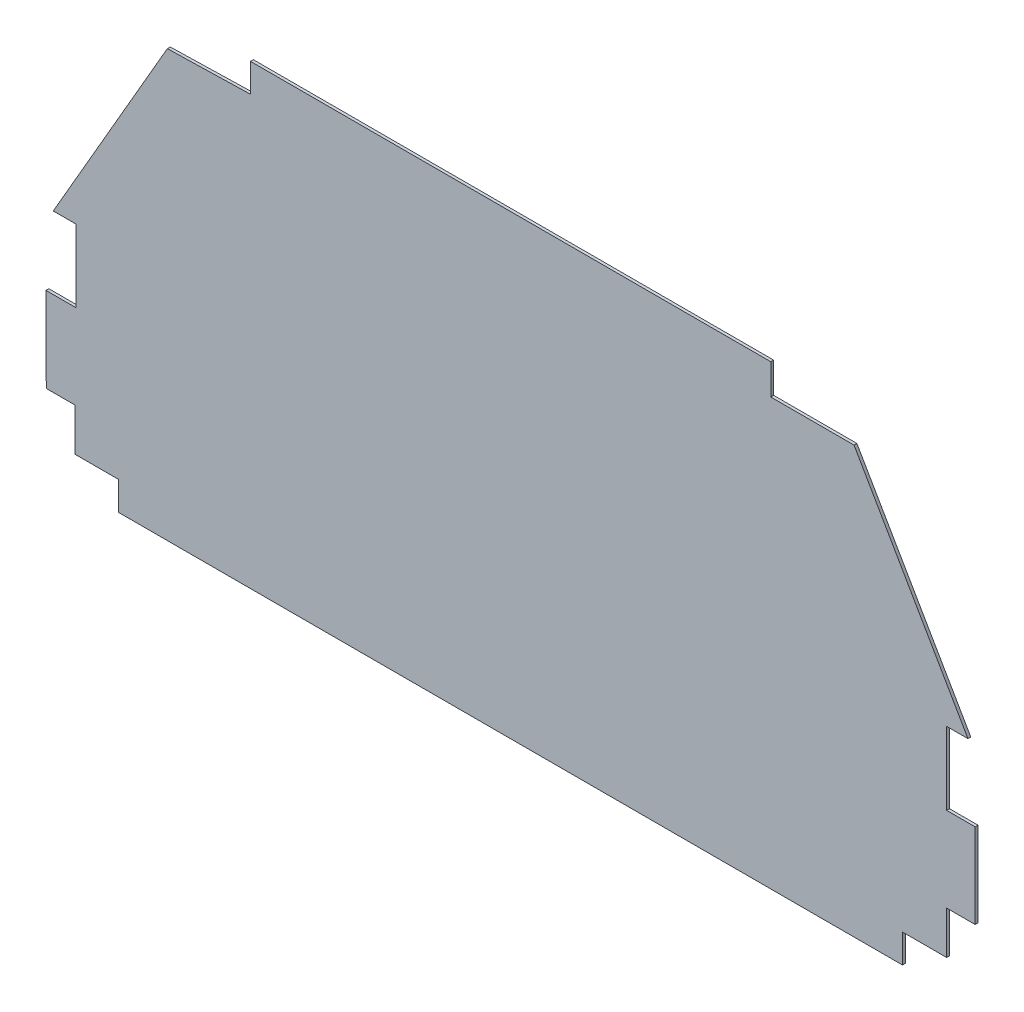
ISO-10303-21;
HEADER;
FILE_DESCRIPTION(('STEP AP214'),'2;1');
FILE_NAME('part.step','',(''),(''),'','','');
FILE_SCHEMA(('AUTOMOTIVE_DESIGN { 1 0 10303 214 1 1 1 1 }'));
ENDSEC;
DATA;
#1=APPLICATION_CONTEXT('core data for automotive mechanical design processes');
#2=APPLICATION_PROTOCOL_DEFINITION('international standard','automotive_design',2000,#1);
#3=PRODUCT_CONTEXT('',#1,'mechanical');
#4=PRODUCT('Part','Part','',(#3));
#5=PRODUCT_RELATED_PRODUCT_CATEGORY('part','',(#4));
#6=PRODUCT_DEFINITION_FORMATION('','',#4);
#7=PRODUCT_DEFINITION_CONTEXT('part definition',#1,'design');
#8=PRODUCT_DEFINITION('design','',#6,#7);
#9=PRODUCT_DEFINITION_SHAPE('','',#8);
#10=(LENGTH_UNIT() NAMED_UNIT(*) SI_UNIT(.MILLI.,.METRE.));
#11=(NAMED_UNIT(*) PLANE_ANGLE_UNIT() SI_UNIT($,.RADIAN.));
#12=(NAMED_UNIT(*) SI_UNIT($,.STERADIAN.) SOLID_ANGLE_UNIT());
#13=UNCERTAINTY_MEASURE_WITH_UNIT(LENGTH_MEASURE(1.E-05),#10,'distance_accuracy_value','');
#14=(GEOMETRIC_REPRESENTATION_CONTEXT(3) GLOBAL_UNCERTAINTY_ASSIGNED_CONTEXT((#13)) GLOBAL_UNIT_ASSIGNED_CONTEXT((#10,
#11,#12)) REPRESENTATION_CONTEXT('',''));
#15=CARTESIAN_POINT('',(0.,0.,0.));
#16=DIRECTION('',(0.,0.,1.));
#17=DIRECTION('',(1.,0.,0.));
#18=AXIS2_PLACEMENT_3D('',#15,#16,#17);
#19=CARTESIAN_POINT('',(497.289305676429,278.585286053824,2.));
#20=DIRECTION('',(-1.,0.,0.));
#21=DIRECTION('',(0.,0.,1.));
#22=AXIS2_PLACEMENT_3D('',#19,#20,#21);
#23=PLANE('',#22);
#24=DIRECTION('',(0.,1.,0.));
#25=VECTOR('',#24,1.);
#26=CARTESIAN_POINT('',(497.289305676429,278.585286053824,0.));
#27=LINE('',#26,#25);
#28=CARTESIAN_POINT('',(497.289305676429,278.585286053824,0.));
#29=VERTEX_POINT('',#28);
#30=CARTESIAN_POINT('',(497.289305676429,300.001319811247,0.));
#31=VERTEX_POINT('',#30);
#32=EDGE_CURVE('E224',#29,#31,#27,.T.);
#33=ORIENTED_EDGE('',*,*,#32,.T.);
#34=DIRECTION('',(0.,0.,-1.));
#35=VECTOR('',#34,1.);
#36=CARTESIAN_POINT('',(497.289305676429,300.001319811247,2.));
#37=LINE('',#36,#35);
#38=CARTESIAN_POINT('',(497.289305676429,300.001319811247,2.));
#39=VERTEX_POINT('',#38);
#40=EDGE_CURVE('E11',#39,#31,#37,.T.);
#41=ORIENTED_EDGE('',*,*,#40,.F.);
#42=DIRECTION('',(0.,1.,0.));
#43=VECTOR('',#42,1.);
#44=CARTESIAN_POINT('',(497.289305676429,278.585286053824,2.));
#45=LINE('',#44,#43);
#46=CARTESIAN_POINT('',(497.289305676429,278.585286053824,2.));
#47=VERTEX_POINT('',#46);
#48=EDGE_CURVE('E270',#47,#39,#45,.T.);
#49=ORIENTED_EDGE('',*,*,#48,.F.);
#50=DIRECTION('',(0.,0.,-1.));
#51=VECTOR('',#50,1.);
#52=CARTESIAN_POINT('',(497.289305676429,278.585286053824,2.));
#53=LINE('',#52,#51);
#54=EDGE_CURVE('E220',#47,#29,#53,.T.);
#55=ORIENTED_EDGE('',*,*,#54,.T.);
#56=EDGE_LOOP('',(#33,#41,#49,#55));
#57=FACE_BOUND('',#56,.T.);
#58=ADVANCED_FACE('F32',(#57),#23,.F.);
#59=CARTESIAN_POINT('',(497.289305676429,300.001319811247,2.));
#60=DIRECTION('',(0.,-1.,0.));
#61=DIRECTION('',(0.,0.,-1.));
#62=AXIS2_PLACEMENT_3D('',#59,#60,#61);
#63=PLANE('',#62);
#64=DIRECTION('',(-1.,0.,0.));
#65=VECTOR('',#64,1.);
#66=CARTESIAN_POINT('',(497.289305676429,300.001319811247,0.));
#67=LINE('',#66,#65);
#68=CARTESIAN_POINT('',(132.637060910832,300.001319811247,0.));
#69=VERTEX_POINT('',#68);
#70=EDGE_CURVE('E227',#31,#69,#67,.T.);
#71=ORIENTED_EDGE('',*,*,#70,.T.);
#72=DIRECTION('',(0.,0.,-1.));
#73=VECTOR('',#72,1.);
#74=CARTESIAN_POINT('',(132.637060910832,300.001319811247,2.));
#75=LINE('',#74,#73);
#76=CARTESIAN_POINT('',(132.637060910832,300.001319811247,2.));
#77=VERTEX_POINT('',#76);
#78=EDGE_CURVE('E40',#77,#69,#75,.T.);
#79=ORIENTED_EDGE('',*,*,#78,.F.);
#80=DIRECTION('',(-1.,0.,0.));
#81=VECTOR('',#80,1.);
#82=CARTESIAN_POINT('',(497.289305676429,300.001319811247,2.));
#83=LINE('',#82,#81);
#84=EDGE_CURVE('E139',#39,#77,#83,.T.);
#85=ORIENTED_EDGE('',*,*,#84,.F.);
#86=ORIENTED_EDGE('',*,*,#40,.T.);
#87=EDGE_LOOP('',(#71,#79,#85,#86));
#88=FACE_BOUND('',#87,.T.);
#89=ADVANCED_FACE('F408',(#88),#63,.F.);
#90=CARTESIAN_POINT('',(132.637060910832,300.001319811247,2.));
#91=DIRECTION('',(1.,0.,0.));
#92=DIRECTION('',(0.,0.,-1.));
#93=AXIS2_PLACEMENT_3D('',#90,#91,#92);
#94=PLANE('',#93);
#95=DIRECTION('',(0.,-1.,0.));
#96=VECTOR('',#95,1.);
#97=CARTESIAN_POINT('',(132.637060910832,300.001319811247,0.));
#98=LINE('',#97,#96);
#99=CARTESIAN_POINT('',(132.637060910832,280.002634605282,0.));
#100=VERTEX_POINT('',#99);
#101=EDGE_CURVE('E229',#69,#100,#98,.T.);
#102=ORIENTED_EDGE('',*,*,#101,.T.);
#103=DIRECTION('',(0.,0.,-1.));
#104=VECTOR('',#103,1.);
#105=CARTESIAN_POINT('',(132.637060910832,280.002634605282,2.));
#106=LINE('',#105,#104);
#107=CARTESIAN_POINT('',(132.637060910832,280.002634605282,2.));
#108=VERTEX_POINT('',#107);
#109=EDGE_CURVE('E325',#108,#100,#106,.T.);
#110=ORIENTED_EDGE('',*,*,#109,.F.);
#111=DIRECTION('',(0.,-1.,0.));
#112=VECTOR('',#111,1.);
#113=CARTESIAN_POINT('',(132.637060910832,300.001319811247,2.));
#114=LINE('',#113,#112);
#115=EDGE_CURVE('E333',#77,#108,#114,.T.);
#116=ORIENTED_EDGE('',*,*,#115,.F.);
#117=ORIENTED_EDGE('',*,*,#78,.T.);
#118=EDGE_LOOP('',(#102,#110,#116,#117));
#119=FACE_BOUND('',#118,.T.);
#120=ADVANCED_FACE('F331',(#119),#94,.F.);
#121=CARTESIAN_POINT('',(132.637060910832,280.002634605282,2.));
#122=DIRECTION('',(0.0243191662018815,-0.999704245342214,0.));
#123=DIRECTION('',(0.999704245342214,0.0243191662018815,0.));
#124=AXIS2_PLACEMENT_3D('',#121,#122,#123);
#125=PLANE('',#124);
#126=DIRECTION('',(-0.999704245342214,-0.0243191662018815,0.));
#127=VECTOR('',#126,1.);
#128=CARTESIAN_POINT('',(132.637060910832,280.002634605282,0.));
#129=LINE('',#128,#127);
#130=CARTESIAN_POINT('',(74.3731651728003,278.585286053824,0.));
#131=VERTEX_POINT('',#130);
#132=EDGE_CURVE('E231',#100,#131,#129,.T.);
#133=ORIENTED_EDGE('',*,*,#132,.T.);
#134=DIRECTION('',(0.,0.,-1.));
#135=VECTOR('',#134,1.);
#136=CARTESIAN_POINT('',(74.3731651728003,278.585286053824,2.));
#137=LINE('',#136,#135);
#138=CARTESIAN_POINT('',(74.3731651728003,278.585286053824,2.));
#139=VERTEX_POINT('',#138);
#140=EDGE_CURVE('E322',#139,#131,#137,.T.);
#141=ORIENTED_EDGE('',*,*,#140,.F.);
#142=DIRECTION('',(-0.999704245342214,-0.0243191662018815,0.));
#143=VECTOR('',#142,1.);
#144=CARTESIAN_POINT('',(132.637060910832,280.002634605282,2.));
#145=LINE('',#144,#143);
#146=EDGE_CURVE('E351',#108,#139,#145,.T.);
#147=ORIENTED_EDGE('',*,*,#146,.F.);
#148=ORIENTED_EDGE('',*,*,#109,.T.);
#149=EDGE_LOOP('',(#133,#141,#147,#148));
#150=FACE_BOUND('',#149,.T.);
#151=ADVANCED_FACE('F342',(#150),#125,.F.);
#152=CARTESIAN_POINT('',(74.3731651728003,278.585286053824,2.));
#153=DIRECTION('',(0.86602540378444,-0.499999999999998,0.));
#154=DIRECTION('',(0.499999999999998,0.86602540378444,0.));
#155=AXIS2_PLACEMENT_3D('',#152,#153,#154);
#156=PLANE('',#155);
#157=DIRECTION('',(-0.499999999999998,-0.86602540378444,0.));
#158=VECTOR('',#157,1.);
#159=CARTESIAN_POINT('',(74.3731651728003,278.585286053824,0.));
#160=LINE('',#159,#158);
#161=CARTESIAN_POINT('',(-5.60837800968179,140.053189594,0.));
#162=VERTEX_POINT('',#161);
#163=EDGE_CURVE('E233',#131,#162,#160,.T.);
#164=ORIENTED_EDGE('',*,*,#163,.T.);
#165=DIRECTION('',(0.,0.,-1.));
#166=VECTOR('',#165,1.);
#167=CARTESIAN_POINT('',(-5.60837800968179,140.053189594,2.));
#168=LINE('',#167,#166);
#169=CARTESIAN_POINT('',(-5.60837800968179,140.053189594,2.));
#170=VERTEX_POINT('',#169);
#171=EDGE_CURVE('E319',#170,#162,#168,.T.);
#172=ORIENTED_EDGE('',*,*,#171,.F.);
#173=DIRECTION('',(-0.499999999999998,-0.86602540378444,0.));
#174=VECTOR('',#173,1.);
#175=CARTESIAN_POINT('',(74.3731651728003,278.585286053824,2.));
#176=LINE('',#175,#174);
#177=EDGE_CURVE('E348',#139,#170,#176,.T.);
#178=ORIENTED_EDGE('',*,*,#177,.F.);
#179=ORIENTED_EDGE('',*,*,#140,.T.);
#180=EDGE_LOOP('',(#164,#172,#178,#179));
#181=FACE_BOUND('',#180,.T.);
#182=ADVANCED_FACE('F346',(#181),#156,.F.);
#183=CARTESIAN_POINT('',(-5.60837800968179,140.053189594,2.));
#184=DIRECTION('',(0.,1.,0.));
#185=DIRECTION('',(0.,0.,1.));
#186=AXIS2_PLACEMENT_3D('',#183,#184,#185);
#187=PLANE('',#186);
#188=DIRECTION('',(1.,0.,0.));
#189=VECTOR('',#188,1.);
#190=CARTESIAN_POINT('',(-5.60837800968179,140.053189594,0.));
#191=LINE('',#190,#189);
#192=CARTESIAN_POINT('',(10.2677569774963,140.053189594,0.));
#193=VERTEX_POINT('',#192);
#194=EDGE_CURVE('E235',#162,#193,#191,.T.);
#195=ORIENTED_EDGE('',*,*,#194,.T.);
#196=DIRECTION('',(0.,0.,-1.));
#197=VECTOR('',#196,1.);
#198=CARTESIAN_POINT('',(10.2677569774963,140.053189594,2.));
#199=LINE('',#198,#197);
#200=CARTESIAN_POINT('',(10.2677569774963,140.053189594,2.));
#201=VERTEX_POINT('',#200);
#202=EDGE_CURVE('E316',#201,#193,#199,.T.);
#203=ORIENTED_EDGE('',*,*,#202,.F.);
#204=DIRECTION('',(1.,0.,0.));
#205=VECTOR('',#204,1.);
#206=CARTESIAN_POINT('',(-5.60837800968179,140.053189594,2.));
#207=LINE('',#206,#205);
#208=EDGE_CURVE('E350',#170,#201,#207,.T.);
#209=ORIENTED_EDGE('',*,*,#208,.F.);
#210=ORIENTED_EDGE('',*,*,#171,.T.);
#211=EDGE_LOOP('',(#195,#203,#209,#210));
#212=FACE_BOUND('',#211,.T.);
#213=ADVANCED_FACE('F421',(#212),#187,.F.);
#214=CARTESIAN_POINT('',(10.2677569774963,140.053189594,2.));
#215=DIRECTION('',(1.,0.,0.));
#216=DIRECTION('',(0.,0.,-1.));
#217=AXIS2_PLACEMENT_3D('',#214,#215,#216);
#218=PLANE('',#217);
#219=DIRECTION('',(0.,-1.,0.));
#220=VECTOR('',#219,1.);
#221=CARTESIAN_POINT('',(10.2677569774963,140.053189594,0.));
#222=LINE('',#221,#220);
#223=CARTESIAN_POINT('',(10.2677569774963,89.3200693598193,0.));
#224=VERTEX_POINT('',#223);
#225=EDGE_CURVE('E237',#193,#224,#222,.T.);
#226=ORIENTED_EDGE('',*,*,#225,.T.);
#227=DIRECTION('',(0.,0.,-1.));
#228=VECTOR('',#227,1.);
#229=CARTESIAN_POINT('',(10.2677569774963,89.3200693598193,2.));
#230=LINE('',#229,#228);
#231=CARTESIAN_POINT('',(10.2677569774963,89.3200693598193,2.));
#232=VERTEX_POINT('',#231);
#233=EDGE_CURVE('E313',#232,#224,#230,.T.);
#234=ORIENTED_EDGE('',*,*,#233,.F.);
#235=DIRECTION('',(0.,-1.,0.));
#236=VECTOR('',#235,1.);
#237=CARTESIAN_POINT('',(10.2677569774963,140.053189594,2.));
#238=LINE('',#237,#236);
#239=EDGE_CURVE('E353',#201,#232,#238,.T.);
#240=ORIENTED_EDGE('',*,*,#239,.F.);
#241=ORIENTED_EDGE('',*,*,#202,.T.);
#242=EDGE_LOOP('',(#226,#234,#240,#241));
#243=FACE_BOUND('',#242,.T.);
#244=ADVANCED_FACE('F424',(#243),#218,.F.);
#245=CARTESIAN_POINT('',(10.2677569774963,89.3200693598193,2.));
#246=DIRECTION('',(0.,-1.,0.));
#247=DIRECTION('',(0.,0.,-1.));
#248=AXIS2_PLACEMENT_3D('',#245,#246,#247);
#249=PLANE('',#248);
#250=DIRECTION('',(-1.,0.,0.));
#251=VECTOR('',#250,1.);
#252=CARTESIAN_POINT('',(10.2677569774963,89.3200693598193,0.));
#253=LINE('',#252,#251);
#254=CARTESIAN_POINT('',(-10.6892726899618,89.3200693598193,0.));
#255=VERTEX_POINT('',#254);
#256=EDGE_CURVE('E239',#224,#255,#253,.T.);
#257=ORIENTED_EDGE('',*,*,#256,.T.);
#258=DIRECTION('',(0.,0.,-1.));
#259=VECTOR('',#258,1.);
#260=CARTESIAN_POINT('',(-10.6892726899618,89.3200693598193,2.));
#261=LINE('',#260,#259);
#262=CARTESIAN_POINT('',(-10.6892726899618,89.3200693598193,2.));
#263=VERTEX_POINT('',#262);
#264=EDGE_CURVE('E310',#263,#255,#261,.T.);
#265=ORIENTED_EDGE('',*,*,#264,.F.);
#266=DIRECTION('',(-1.,0.,0.));
#267=VECTOR('',#266,1.);
#268=CARTESIAN_POINT('',(10.2677569774963,89.3200693598193,2.));
#269=LINE('',#268,#267);
#270=EDGE_CURVE('E359',#232,#263,#269,.T.);
#271=ORIENTED_EDGE('',*,*,#270,.F.);
#272=ORIENTED_EDGE('',*,*,#233,.T.);
#273=EDGE_LOOP('',(#257,#265,#271,#272));
#274=FACE_BOUND('',#273,.T.);
#275=ADVANCED_FACE('F428',(#274),#249,.F.);
#276=CARTESIAN_POINT('',(-10.6892726899618,89.3200693598193,2.));
#277=DIRECTION('',(0.999994930243962,0.00318425601565733,0.));
#278=DIRECTION('',(-0.00318425601565733,0.999994930243962,0.));
#279=AXIS2_PLACEMENT_3D('',#276,#277,#278);
#280=PLANE('',#279);
#281=DIRECTION('',(0.00318425601565733,-0.999994930243962,0.));
#282=VECTOR('',#281,1.);
#283=CARTESIAN_POINT('',(-10.6892726899618,89.3200693598193,0.));
#284=LINE('',#283,#282);
#285=CARTESIAN_POINT('',(-10.4999999999986,29.880209792566,0.));
#286=VERTEX_POINT('',#285);
#287=EDGE_CURVE('E241',#255,#286,#284,.T.);
#288=ORIENTED_EDGE('',*,*,#287,.T.);
#289=DIRECTION('',(0.,0.,-1.));
#290=VECTOR('',#289,1.);
#291=CARTESIAN_POINT('',(-10.4999999999986,29.880209792566,2.));
#292=LINE('',#291,#290);
#293=CARTESIAN_POINT('',(-10.4999999999986,29.880209792566,2.));
#294=VERTEX_POINT('',#293);
#295=EDGE_CURVE('E307',#294,#286,#292,.T.);
#296=ORIENTED_EDGE('',*,*,#295,.F.);
#297=DIRECTION('',(0.00318425601565733,-0.999994930243962,0.));
#298=VECTOR('',#297,1.);
#299=CARTESIAN_POINT('',(-10.6892726899618,89.3200693598193,2.));
#300=LINE('',#299,#298);
#301=EDGE_CURVE('E361',#263,#294,#300,.T.);
#302=ORIENTED_EDGE('',*,*,#301,.F.);
#303=ORIENTED_EDGE('',*,*,#264,.T.);
#304=EDGE_LOOP('',(#288,#296,#302,#303));
#305=FACE_BOUND('',#304,.T.);
#306=ADVANCED_FACE('F432',(#305),#280,.F.);
#307=CARTESIAN_POINT('',(-10.4999999999986,29.880209792566,2.));
#308=DIRECTION('',(0.,1.,0.));
#309=DIRECTION('',(0.,0.,1.));
#310=AXIS2_PLACEMENT_3D('',#307,#308,#309);
#311=PLANE('',#310);
#312=DIRECTION('',(1.,0.,0.));
#313=VECTOR('',#312,1.);
#314=CARTESIAN_POINT('',(-10.4999999999986,29.880209792566,0.));
#315=LINE('',#314,#313);
#316=CARTESIAN_POINT('',(9.49868520596631,29.880209792566,0.));
#317=VERTEX_POINT('',#316);
#318=EDGE_CURVE('E243',#286,#317,#315,.T.);
#319=ORIENTED_EDGE('',*,*,#318,.T.);
#320=DIRECTION('',(0.,0.,-1.));
#321=VECTOR('',#320,1.);
#322=CARTESIAN_POINT('',(9.49868520596631,29.880209792566,2.));
#323=LINE('',#322,#321);
#324=CARTESIAN_POINT('',(9.49868520596631,29.880209792566,2.));
#325=VERTEX_POINT('',#324);
#326=EDGE_CURVE('E304',#325,#317,#323,.T.);
#327=ORIENTED_EDGE('',*,*,#326,.F.);
#328=DIRECTION('',(1.,0.,0.));
#329=VECTOR('',#328,1.);
#330=CARTESIAN_POINT('',(-10.4999999999986,29.880209792566,2.));
#331=LINE('',#330,#329);
#332=EDGE_CURVE('E363',#294,#325,#331,.T.);
#333=ORIENTED_EDGE('',*,*,#332,.F.);
#334=ORIENTED_EDGE('',*,*,#295,.T.);
#335=EDGE_LOOP('',(#319,#327,#333,#334));
#336=FACE_BOUND('',#335,.T.);
#337=ADVANCED_FACE('F436',(#336),#311,.F.);
#338=CARTESIAN_POINT('',(9.49868520596631,29.880209792566,2.));
#339=DIRECTION('',(1.,0.,0.));
#340=DIRECTION('',(0.,1.,0.));
#341=AXIS2_PLACEMENT_3D('',#338,#339,#340);
#342=PLANE('',#341);
#343=DIRECTION('',(0.,-1.,0.));
#344=VECTOR('',#343,1.);
#345=CARTESIAN_POINT('',(9.49868520596631,29.880209792566,0.));
#346=LINE('',#345,#344);
#347=CARTESIAN_POINT('',(9.49868520596639,-0.000432002205452697,0.));
#348=VERTEX_POINT('',#347);
#349=EDGE_CURVE('E245',#317,#348,#346,.T.);
#350=ORIENTED_EDGE('',*,*,#349,.T.);
#351=DIRECTION('',(0.,0.,-1.));
#352=VECTOR('',#351,1.);
#353=CARTESIAN_POINT('',(9.49868520596639,-0.000432002205452697,2.));
#354=LINE('',#353,#352);
#355=CARTESIAN_POINT('',(9.49868520596639,-0.000432002205452697,2.));
#356=VERTEX_POINT('',#355);
#357=EDGE_CURVE('E301',#356,#348,#354,.T.);
#358=ORIENTED_EDGE('',*,*,#357,.F.);
#359=DIRECTION('',(0.,-1.,0.));
#360=VECTOR('',#359,1.);
#361=CARTESIAN_POINT('',(9.49868520596631,29.880209792566,2.));
#362=LINE('',#361,#360);
#363=EDGE_CURVE('E365',#325,#356,#362,.T.);
#364=ORIENTED_EDGE('',*,*,#363,.F.);
#365=ORIENTED_EDGE('',*,*,#326,.T.);
#366=EDGE_LOOP('',(#350,#358,#364,#365));
#367=FACE_BOUND('',#366,.T.);
#368=ADVANCED_FACE('F440',(#367),#342,.F.);
#369=CARTESIAN_POINT('',(9.49868520596639,-0.000432002205452697,2.));
#370=DIRECTION('',(0.,1.,0.));
#371=DIRECTION('',(-1.,0.,0.));
#372=AXIS2_PLACEMENT_3D('',#369,#370,#371);
#373=PLANE('',#372);
#374=DIRECTION('',(1.,0.,0.));
#375=VECTOR('',#374,1.);
#376=CARTESIAN_POINT('',(9.49868520596639,-0.000432002205452697,0.));
#377=LINE('',#376,#375);
#378=CARTESIAN_POINT('',(40.2838033638497,-0.000432002205230653,0.));
#379=VERTEX_POINT('',#378);
#380=EDGE_CURVE('E247',#348,#379,#377,.T.);
#381=ORIENTED_EDGE('',*,*,#380,.T.);
#382=DIRECTION('',(0.,0.,-1.));
#383=VECTOR('',#382,1.);
#384=CARTESIAN_POINT('',(40.2838033638497,-0.000432002205230653,2.));
#385=LINE('',#384,#383);
#386=CARTESIAN_POINT('',(40.2838033638497,-0.000432002205230653,2.));
#387=VERTEX_POINT('',#386);
#388=EDGE_CURVE('E298',#387,#379,#385,.T.);
#389=ORIENTED_EDGE('',*,*,#388,.F.);
#390=DIRECTION('',(1.,0.,0.));
#391=VECTOR('',#390,1.);
#392=CARTESIAN_POINT('',(9.49868520596639,-0.000432002205452697,2.));
#393=LINE('',#392,#391);
#394=EDGE_CURVE('E367',#356,#387,#393,.T.);
#395=ORIENTED_EDGE('',*,*,#394,.F.);
#396=ORIENTED_EDGE('',*,*,#357,.T.);
#397=EDGE_LOOP('',(#381,#389,#395,#396));
#398=FACE_BOUND('',#397,.T.);
#399=ADVANCED_FACE('F444',(#398),#373,.F.);
#400=CARTESIAN_POINT('',(40.2838033638497,-0.000432002205230653,2.));
#401=DIRECTION('',(1.,0.,0.));
#402=DIRECTION('',(0.,0.,-1.));
#403=AXIS2_PLACEMENT_3D('',#400,#401,#402);
#404=PLANE('',#403);
#405=DIRECTION('',(0.,-1.,0.));
#406=VECTOR('',#405,1.);
#407=CARTESIAN_POINT('',(40.2838033638497,-0.000432002205230653,0.));
#408=LINE('',#407,#406);
#409=CARTESIAN_POINT('',(40.2838033638497,-20.0284000547623,0.));
#410=VERTEX_POINT('',#409);
#411=EDGE_CURVE('E249',#379,#410,#408,.T.);
#412=ORIENTED_EDGE('',*,*,#411,.T.);
#413=DIRECTION('',(0.,0.,-1.));
#414=VECTOR('',#413,1.);
#415=CARTESIAN_POINT('',(40.2838033638497,-20.0284000547623,2.));
#416=LINE('',#415,#414);
#417=CARTESIAN_POINT('',(40.2838033638497,-20.0284000547623,2.));
#418=VERTEX_POINT('',#417);
#419=EDGE_CURVE('E295',#418,#410,#416,.T.);
#420=ORIENTED_EDGE('',*,*,#419,.F.);
#421=DIRECTION('',(0.,-1.,0.));
#422=VECTOR('',#421,1.);
#423=CARTESIAN_POINT('',(40.2838033638497,-0.000432002205230653,2.));
#424=LINE('',#423,#422);
#425=EDGE_CURVE('E369',#387,#418,#424,.T.);
#426=ORIENTED_EDGE('',*,*,#425,.F.);
#427=ORIENTED_EDGE('',*,*,#388,.T.);
#428=EDGE_LOOP('',(#412,#420,#426,#427));
#429=FACE_BOUND('',#428,.T.);
#430=ADVANCED_FACE('F448',(#429),#404,.F.);
#431=CARTESIAN_POINT('',(40.2838033638497,-20.0284000547623,2.));
#432=DIRECTION('',(0.,1.,0.));
#433=DIRECTION('',(0.,0.,1.));
#434=AXIS2_PLACEMENT_3D('',#431,#432,#433);
#435=PLANE('',#434);
#436=DIRECTION('',(1.,0.,0.));
#437=VECTOR('',#436,1.);
#438=CARTESIAN_POINT('',(40.2838033638497,-20.0284000547623,0.));
#439=LINE('',#438,#437);
#440=CARTESIAN_POINT('',(589.58971805308,-20.0284000547623,0.));
#441=VERTEX_POINT('',#440);
#442=EDGE_CURVE('E251',#410,#441,#439,.T.);
#443=ORIENTED_EDGE('',*,*,#442,.T.);
#444=DIRECTION('',(0.,0.,-1.));
#445=VECTOR('',#444,1.);
#446=CARTESIAN_POINT('',(589.58971805308,-20.0284000547623,2.));
#447=LINE('',#446,#445);
#448=CARTESIAN_POINT('',(589.58971805308,-20.0284000547623,2.));
#449=VERTEX_POINT('',#448);
#450=EDGE_CURVE('E292',#449,#441,#447,.T.);
#451=ORIENTED_EDGE('',*,*,#450,.F.);
#452=DIRECTION('',(1.,0.,0.));
#453=VECTOR('',#452,1.);
#454=CARTESIAN_POINT('',(40.2838033638497,-20.0284000547623,2.));
#455=LINE('',#454,#453);
#456=EDGE_CURVE('E371',#418,#449,#455,.T.);
#457=ORIENTED_EDGE('',*,*,#456,.F.);
#458=ORIENTED_EDGE('',*,*,#419,.T.);
#459=EDGE_LOOP('',(#443,#451,#457,#458));
#460=FACE_BOUND('',#459,.T.);
#461=ADVANCED_FACE('F452',(#460),#435,.F.);
#462=CARTESIAN_POINT('',(589.58971805308,-20.0284000547623,2.));
#463=DIRECTION('',(-1.,0.,0.));
#464=DIRECTION('',(0.,0.,1.));
#465=AXIS2_PLACEMENT_3D('',#462,#463,#464);
#466=PLANE('',#465);
#467=DIRECTION('',(0.,1.,0.));
#468=VECTOR('',#467,1.);
#469=CARTESIAN_POINT('',(589.58971805308,-20.0284000547623,0.));
#470=LINE('',#469,#468);
#471=CARTESIAN_POINT('',(589.58971805308,-0.000432002203343274,0.));
#472=VERTEX_POINT('',#471);
#473=EDGE_CURVE('E253',#441,#472,#470,.T.);
#474=ORIENTED_EDGE('',*,*,#473,.T.);
#475=DIRECTION('',(0.,0.,-1.));
#476=VECTOR('',#475,1.);
#477=CARTESIAN_POINT('',(589.58971805308,-0.000432002203343274,2.));
#478=LINE('',#477,#476);
#479=CARTESIAN_POINT('',(589.58971805308,-0.000432002203343274,2.));
#480=VERTEX_POINT('',#479);
#481=EDGE_CURVE('E289',#480,#472,#478,.T.);
#482=ORIENTED_EDGE('',*,*,#481,.F.);
#483=DIRECTION('',(0.,1.,0.));
#484=VECTOR('',#483,1.);
#485=CARTESIAN_POINT('',(589.58971805308,-20.0284000547623,2.));
#486=LINE('',#485,#484);
#487=EDGE_CURVE('E373',#449,#480,#486,.T.);
#488=ORIENTED_EDGE('',*,*,#487,.F.);
#489=ORIENTED_EDGE('',*,*,#450,.T.);
#490=EDGE_LOOP('',(#474,#482,#488,#489));
#491=FACE_BOUND('',#490,.T.);
#492=ADVANCED_FACE('F456',(#491),#466,.F.);
#493=CARTESIAN_POINT('',(589.58971805308,-0.000432002203343274,2.));
#494=DIRECTION('',(0.,1.,0.));
#495=DIRECTION('',(-1.,0.,0.));
#496=AXIS2_PLACEMENT_3D('',#493,#494,#495);
#497=PLANE('',#496);
#498=DIRECTION('',(1.,0.,0.));
#499=VECTOR('',#498,1.);
#500=CARTESIAN_POINT('',(589.58971805308,-0.000432002203343274,0.));
#501=LINE('',#500,#499);
#502=CARTESIAN_POINT('',(620.501751813453,-0.000432002203232251,0.));
#503=VERTEX_POINT('',#502);
#504=EDGE_CURVE('E255',#472,#503,#501,.T.);
#505=ORIENTED_EDGE('',*,*,#504,.T.);
#506=DIRECTION('',(0.,0.,-1.));
#507=VECTOR('',#506,1.);
#508=CARTESIAN_POINT('',(620.501751813453,-0.000432002203232251,2.));
#509=LINE('',#508,#507);
#510=CARTESIAN_POINT('',(620.501751813453,-0.000432002203232251,2.));
#511=VERTEX_POINT('',#510);
#512=EDGE_CURVE('E286',#511,#503,#509,.T.);
#513=ORIENTED_EDGE('',*,*,#512,.F.);
#514=DIRECTION('',(1.,0.,0.));
#515=VECTOR('',#514,1.);
#516=CARTESIAN_POINT('',(589.58971805308,-0.000432002203343274,2.));
#517=LINE('',#516,#515);
#518=EDGE_CURVE('E375',#480,#511,#517,.T.);
#519=ORIENTED_EDGE('',*,*,#518,.F.);
#520=ORIENTED_EDGE('',*,*,#481,.T.);
#521=EDGE_LOOP('',(#505,#513,#519,#520));
#522=FACE_BOUND('',#521,.T.);
#523=ADVANCED_FACE('F460',(#522),#497,.F.);
#524=CARTESIAN_POINT('',(620.501751813453,-0.000432002203232251,2.));
#525=DIRECTION('',(-1.,0.,0.));
#526=DIRECTION('',(0.,-1.,0.));
#527=AXIS2_PLACEMENT_3D('',#524,#525,#526);
#528=PLANE('',#527);
#529=DIRECTION('',(0.,1.,0.));
#530=VECTOR('',#529,1.);
#531=CARTESIAN_POINT('',(620.501751813453,-0.000432002203232251,0.));
#532=LINE('',#531,#530);
#533=CARTESIAN_POINT('',(620.501751813453,30.0074740018542,0.));
#534=VERTEX_POINT('',#533);
#535=EDGE_CURVE('E257',#503,#534,#532,.T.);
#536=ORIENTED_EDGE('',*,*,#535,.T.);
#537=DIRECTION('',(0.,0.,-1.));
#538=VECTOR('',#537,1.);
#539=CARTESIAN_POINT('',(620.501751813453,30.0074740018542,2.));
#540=LINE('',#539,#538);
#541=CARTESIAN_POINT('',(620.501751813453,30.0074740018542,2.));
#542=VERTEX_POINT('',#541);
#543=EDGE_CURVE('E283',#542,#534,#540,.T.);
#544=ORIENTED_EDGE('',*,*,#543,.F.);
#545=DIRECTION('',(0.,1.,0.));
#546=VECTOR('',#545,1.);
#547=CARTESIAN_POINT('',(620.501751813453,-0.000432002203232251,2.));
#548=LINE('',#547,#546);
#549=EDGE_CURVE('E377',#511,#542,#548,.T.);
#550=ORIENTED_EDGE('',*,*,#549,.F.);
#551=ORIENTED_EDGE('',*,*,#512,.T.);
#552=EDGE_LOOP('',(#536,#544,#550,#551));
#553=FACE_BOUND('',#552,.T.);
#554=ADVANCED_FACE('F464',(#553),#528,.F.);
#555=CARTESIAN_POINT('',(620.501751813453,30.0074740018542,2.));
#556=DIRECTION('',(0.,1.,0.));
#557=DIRECTION('',(0.,0.,1.));
#558=AXIS2_PLACEMENT_3D('',#555,#556,#557);
#559=PLANE('',#558);
#560=DIRECTION('',(1.,0.,0.));
#561=VECTOR('',#560,1.);
#562=CARTESIAN_POINT('',(620.501751813453,30.0074740018542,0.));
#563=LINE('',#562,#561);
#564=CARTESIAN_POINT('',(640.500437019418,30.0074740018542,0.));
#565=VERTEX_POINT('',#564);
#566=EDGE_CURVE('E259',#534,#565,#563,.T.);
#567=ORIENTED_EDGE('',*,*,#566,.T.);
#568=DIRECTION('',(0.,0.,-1.));
#569=VECTOR('',#568,1.);
#570=CARTESIAN_POINT('',(640.500437019418,30.0074740018542,2.));
#571=LINE('',#570,#569);
#572=CARTESIAN_POINT('',(640.500437019418,30.0074740018542,2.));
#573=VERTEX_POINT('',#572);
#574=EDGE_CURVE('E280',#573,#565,#571,.T.);
#575=ORIENTED_EDGE('',*,*,#574,.F.);
#576=DIRECTION('',(1.,0.,0.));
#577=VECTOR('',#576,1.);
#578=CARTESIAN_POINT('',(620.501751813453,30.0074740018542,2.));
#579=LINE('',#578,#577);
#580=EDGE_CURVE('E379',#542,#573,#579,.T.);
#581=ORIENTED_EDGE('',*,*,#580,.F.);
#582=ORIENTED_EDGE('',*,*,#543,.T.);
#583=EDGE_LOOP('',(#567,#575,#581,#582));
#584=FACE_BOUND('',#583,.T.);
#585=ADVANCED_FACE('F468',(#584),#559,.F.);
#586=CARTESIAN_POINT('',(640.500437019418,30.0074740018542,2.));
#587=DIRECTION('',(-1.,0.,0.));
#588=DIRECTION('',(0.,-1.,0.));
#589=AXIS2_PLACEMENT_3D('',#586,#587,#588);
#590=PLANE('',#589);
#591=DIRECTION('',(0.,1.,0.));
#592=VECTOR('',#591,1.);
#593=CARTESIAN_POINT('',(640.500437019418,30.0074740018542,0.));
#594=LINE('',#593,#592);
#595=CARTESIAN_POINT('',(640.500437019418,89.3200693598193,0.));
#596=VERTEX_POINT('',#595);
#597=EDGE_CURVE('E261',#565,#596,#594,.T.);
#598=ORIENTED_EDGE('',*,*,#597,.T.);
#599=DIRECTION('',(0.,0.,-1.));
#600=VECTOR('',#599,1.);
#601=CARTESIAN_POINT('',(640.500437019418,89.3200693598193,2.));
#602=LINE('',#601,#600);
#603=CARTESIAN_POINT('',(640.500437019418,89.3200693598193,2.));
#604=VERTEX_POINT('',#603);
#605=EDGE_CURVE('E277',#604,#596,#602,.T.);
#606=ORIENTED_EDGE('',*,*,#605,.F.);
#607=DIRECTION('',(0.,1.,0.));
#608=VECTOR('',#607,1.);
#609=CARTESIAN_POINT('',(640.500437019418,30.0074740018542,2.));
#610=LINE('',#609,#608);
#611=EDGE_CURVE('E381',#573,#604,#610,.T.);
#612=ORIENTED_EDGE('',*,*,#611,.F.);
#613=ORIENTED_EDGE('',*,*,#574,.T.);
#614=EDGE_LOOP('',(#598,#606,#612,#613));
#615=FACE_BOUND('',#614,.T.);
#616=ADVANCED_FACE('F472',(#615),#590,.F.);
#617=CARTESIAN_POINT('',(640.500437019418,89.3200693598193,2.));
#618=DIRECTION('',(0.,-1.,0.));
#619=DIRECTION('',(0.,0.,-1.));
#620=AXIS2_PLACEMENT_3D('',#617,#618,#619);
#621=PLANE('',#620);
#622=DIRECTION('',(-1.,0.,0.));
#623=VECTOR('',#622,1.);
#624=CARTESIAN_POINT('',(640.500437019418,89.3200693598193,0.));
#625=LINE('',#624,#623);
#626=CARTESIAN_POINT('',(620.501751813453,89.3200693598193,0.));
#627=VERTEX_POINT('',#626);
#628=EDGE_CURVE('E263',#596,#627,#625,.T.);
#629=ORIENTED_EDGE('',*,*,#628,.T.);
#630=DIRECTION('',(0.,0.,-1.));
#631=VECTOR('',#630,1.);
#632=CARTESIAN_POINT('',(620.501751813453,89.3200693598193,2.));
#633=LINE('',#632,#631);
#634=CARTESIAN_POINT('',(620.501751813453,89.3200693598193,2.));
#635=VERTEX_POINT('',#634);
#636=EDGE_CURVE('E274',#635,#627,#633,.T.);
#637=ORIENTED_EDGE('',*,*,#636,.F.);
#638=DIRECTION('',(-1.,0.,0.));
#639=VECTOR('',#638,1.);
#640=CARTESIAN_POINT('',(640.500437019418,89.3200693598193,2.));
#641=LINE('',#640,#639);
#642=EDGE_CURVE('E383',#604,#635,#641,.T.);
#643=ORIENTED_EDGE('',*,*,#642,.F.);
#644=ORIENTED_EDGE('',*,*,#605,.T.);
#645=EDGE_LOOP('',(#629,#637,#643,#644));
#646=FACE_BOUND('',#645,.T.);
#647=ADVANCED_FACE('F389',(#646),#621,.F.);
#648=CARTESIAN_POINT('',(620.501751813453,89.3200693598193,2.));
#649=DIRECTION('',(-1.,0.,0.));
#650=DIRECTION('',(0.,0.,1.));
#651=AXIS2_PLACEMENT_3D('',#648,#649,#650);
#652=PLANE('',#651);
#653=DIRECTION('',(0.,1.,0.));
#654=VECTOR('',#653,1.);
#655=CARTESIAN_POINT('',(620.501751813453,89.3200693598193,0.));
#656=LINE('',#655,#654);
#657=CARTESIAN_POINT('',(620.501751813453,140.302065110266,0.));
#658=VERTEX_POINT('',#657);
#659=EDGE_CURVE('E265',#627,#658,#656,.T.);
#660=ORIENTED_EDGE('',*,*,#659,.T.);
#661=DIRECTION('',(0.,0.,-1.));
#662=VECTOR('',#661,1.);
#663=CARTESIAN_POINT('',(620.501751813453,140.302065110266,2.));
#664=LINE('',#663,#662);
#665=CARTESIAN_POINT('',(620.501751813453,140.302065110266,2.));
#666=VERTEX_POINT('',#665);
#667=EDGE_CURVE('E215',#666,#658,#664,.T.);
#668=ORIENTED_EDGE('',*,*,#667,.F.);
#669=DIRECTION('',(0.,1.,0.));
#670=VECTOR('',#669,1.);
#671=CARTESIAN_POINT('',(620.501751813453,89.3200693598193,2.));
#672=LINE('',#671,#670);
#673=EDGE_CURVE('E206',#635,#666,#672,.T.);
#674=ORIENTED_EDGE('',*,*,#673,.F.);
#675=ORIENTED_EDGE('',*,*,#636,.T.);
#676=EDGE_LOOP('',(#660,#668,#674,#675));
#677=FACE_BOUND('',#676,.T.);
#678=ADVANCED_FACE('F393',(#677),#652,.F.);
#679=CARTESIAN_POINT('',(620.501751813453,140.302065110266,2.));
#680=DIRECTION('',(0.,1.,0.));
#681=DIRECTION('',(0.,0.,1.));
#682=AXIS2_PLACEMENT_3D('',#679,#680,#681);
#683=PLANE('',#682);
#684=DIRECTION('',(1.,0.,0.));
#685=VECTOR('',#684,1.);
#686=CARTESIAN_POINT('',(620.501751813453,140.302065110266,0.));
#687=LINE('',#686,#685);
#688=CARTESIAN_POINT('',(635.465126682791,140.302065110266,0.));
#689=VERTEX_POINT('',#688);
#690=EDGE_CURVE('E214',#658,#689,#687,.T.);
#691=ORIENTED_EDGE('',*,*,#690,.T.);
#692=DIRECTION('',(0.,0.,-1.));
#693=VECTOR('',#692,1.);
#694=CARTESIAN_POINT('',(635.465126682791,140.302065110266,2.));
#695=LINE('',#694,#693);
#696=CARTESIAN_POINT('',(635.465126682791,140.302065110266,2.));
#697=VERTEX_POINT('',#696);
#698=EDGE_CURVE('E211',#697,#689,#695,.T.);
#699=ORIENTED_EDGE('',*,*,#698,.F.);
#700=DIRECTION('',(1.,0.,0.));
#701=VECTOR('',#700,1.);
#702=CARTESIAN_POINT('',(620.501751813453,140.302065110266,2.));
#703=LINE('',#702,#701);
#704=EDGE_CURVE('E200',#666,#697,#703,.T.);
#705=ORIENTED_EDGE('',*,*,#704,.F.);
#706=ORIENTED_EDGE('',*,*,#667,.T.);
#707=EDGE_LOOP('',(#691,#699,#705,#706));
#708=FACE_BOUND('',#707,.T.);
#709=ADVANCED_FACE('F212',(#708),#683,.F.);
#710=CARTESIAN_POINT('',(635.465126682791,140.302065110266,2.));
#711=DIRECTION('',(-0.866025403784434,-0.500000000000008,0.));
#712=DIRECTION('',(0.500000000000007,-0.866025403784434,0.));
#713=AXIS2_PLACEMENT_3D('',#710,#711,#712);
#714=PLANE('',#713);
#715=DIRECTION('',(-0.500000000000007,0.866025403784434,0.));
#716=VECTOR('',#715,1.);
#717=CARTESIAN_POINT('',(635.465126682791,140.302065110266,0.));
#718=LINE('',#717,#716);
#719=CARTESIAN_POINT('',(555.627271846618,278.585286053824,0.));
#720=VERTEX_POINT('',#719);
#721=EDGE_CURVE('E125',#689,#720,#718,.T.);
#722=ORIENTED_EDGE('',*,*,#721,.T.);
#723=DIRECTION('',(0.,0.,-1.));
#724=VECTOR('',#723,1.);
#725=CARTESIAN_POINT('',(555.627271846618,278.585286053824,2.));
#726=LINE('',#725,#724);
#727=CARTESIAN_POINT('',(555.627271846618,278.585286053824,2.));
#728=VERTEX_POINT('',#727);
#729=EDGE_CURVE('E216',#728,#720,#726,.T.);
#730=ORIENTED_EDGE('',*,*,#729,.F.);
#731=DIRECTION('',(-0.500000000000007,0.866025403784434,0.));
#732=VECTOR('',#731,1.);
#733=CARTESIAN_POINT('',(635.465126682791,140.302065110266,2.));
#734=LINE('',#733,#732);
#735=EDGE_CURVE('E204',#697,#728,#734,.T.);
#736=ORIENTED_EDGE('',*,*,#735,.F.);
#737=ORIENTED_EDGE('',*,*,#698,.T.);
#738=EDGE_LOOP('',(#722,#730,#736,#737));
#739=FACE_BOUND('',#738,.T.);
#740=ADVANCED_FACE('F218',(#739),#714,.F.);
#741=CARTESIAN_POINT('',(555.627271846618,278.585286053824,2.));
#742=DIRECTION('',(0.,-1.,0.));
#743=DIRECTION('',(0.,0.,-1.));
#744=AXIS2_PLACEMENT_3D('',#741,#742,#743);
#745=PLANE('',#744);
#746=DIRECTION('',(-1.,0.,0.));
#747=VECTOR('',#746,1.);
#748=CARTESIAN_POINT('',(555.627271846618,278.585286053824,0.));
#749=LINE('',#748,#747);
#750=EDGE_CURVE('E131',#720,#29,#749,.T.);
#751=ORIENTED_EDGE('',*,*,#750,.T.);
#752=ORIENTED_EDGE('',*,*,#54,.F.);
#753=DIRECTION('',(-1.,0.,0.));
#754=VECTOR('',#753,1.);
#755=CARTESIAN_POINT('',(555.627271846618,278.585286053824,2.));
#756=LINE('',#755,#754);
#757=EDGE_CURVE('E48',#728,#47,#756,.T.);
#758=ORIENTED_EDGE('',*,*,#757,.F.);
#759=ORIENTED_EDGE('',*,*,#729,.T.);
#760=EDGE_LOOP('',(#751,#752,#758,#759));
#761=FACE_BOUND('',#760,.T.);
#762=ADVANCED_FACE('F397',(#761),#745,.F.);
#763=CARTESIAN_POINT('',(0.,0.,2.));
#764=DIRECTION('',(0.,0.,1.));
#765=DIRECTION('',(1.,0.,0.));
#766=AXIS2_PLACEMENT_3D('',#763,#764,#765);
#767=PLANE('',#766);
#768=ORIENTED_EDGE('',*,*,#48,.T.);
#769=ORIENTED_EDGE('',*,*,#84,.T.);
#770=ORIENTED_EDGE('',*,*,#115,.T.);
#771=ORIENTED_EDGE('',*,*,#146,.T.);
#772=ORIENTED_EDGE('',*,*,#177,.T.);
#773=ORIENTED_EDGE('',*,*,#208,.T.);
#774=ORIENTED_EDGE('',*,*,#239,.T.);
#775=ORIENTED_EDGE('',*,*,#270,.T.);
#776=ORIENTED_EDGE('',*,*,#301,.T.);
#777=ORIENTED_EDGE('',*,*,#332,.T.);
#778=ORIENTED_EDGE('',*,*,#363,.T.);
#779=ORIENTED_EDGE('',*,*,#394,.T.);
#780=ORIENTED_EDGE('',*,*,#425,.T.);
#781=ORIENTED_EDGE('',*,*,#456,.T.);
#782=ORIENTED_EDGE('',*,*,#487,.T.);
#783=ORIENTED_EDGE('',*,*,#518,.T.);
#784=ORIENTED_EDGE('',*,*,#549,.T.);
#785=ORIENTED_EDGE('',*,*,#580,.T.);
#786=ORIENTED_EDGE('',*,*,#611,.T.);
#787=ORIENTED_EDGE('',*,*,#642,.T.);
#788=ORIENTED_EDGE('',*,*,#673,.T.);
#789=ORIENTED_EDGE('',*,*,#704,.T.);
#790=ORIENTED_EDGE('',*,*,#735,.T.);
#791=ORIENTED_EDGE('',*,*,#757,.T.);
#792=EDGE_LOOP('',(#768,#769,#770,#771,#772,#773,#774,#775,#776,#777,#778,#779,#780,#781,#782,
#783,#784,#785,#786,#787,#788,#789,#790,#791));
#793=FACE_BOUND('',#792,.T.);
#794=ADVANCED_FACE('F202',(#793),#767,.T.);
#795=CARTESIAN_POINT('',(0.,0.,0.));
#796=DIRECTION('',(0.,0.,1.));
#797=DIRECTION('',(1.,0.,0.));
#798=AXIS2_PLACEMENT_3D('',#795,#796,#797);
#799=PLANE('',#798);
#800=ORIENTED_EDGE('',*,*,#32,.F.);
#801=ORIENTED_EDGE('',*,*,#750,.F.);
#802=ORIENTED_EDGE('',*,*,#721,.F.);
#803=ORIENTED_EDGE('',*,*,#690,.F.);
#804=ORIENTED_EDGE('',*,*,#659,.F.);
#805=ORIENTED_EDGE('',*,*,#628,.F.);
#806=ORIENTED_EDGE('',*,*,#597,.F.);
#807=ORIENTED_EDGE('',*,*,#566,.F.);
#808=ORIENTED_EDGE('',*,*,#535,.F.);
#809=ORIENTED_EDGE('',*,*,#504,.F.);
#810=ORIENTED_EDGE('',*,*,#473,.F.);
#811=ORIENTED_EDGE('',*,*,#442,.F.);
#812=ORIENTED_EDGE('',*,*,#411,.F.);
#813=ORIENTED_EDGE('',*,*,#380,.F.);
#814=ORIENTED_EDGE('',*,*,#349,.F.);
#815=ORIENTED_EDGE('',*,*,#318,.F.);
#816=ORIENTED_EDGE('',*,*,#287,.F.);
#817=ORIENTED_EDGE('',*,*,#256,.F.);
#818=ORIENTED_EDGE('',*,*,#225,.F.);
#819=ORIENTED_EDGE('',*,*,#194,.F.);
#820=ORIENTED_EDGE('',*,*,#163,.F.);
#821=ORIENTED_EDGE('',*,*,#132,.F.);
#822=ORIENTED_EDGE('',*,*,#101,.F.);
#823=ORIENTED_EDGE('',*,*,#70,.F.);
#824=EDGE_LOOP('',(#800,#801,#802,#803,#804,#805,#806,#807,#808,#809,#810,#811,#812,#813,#814,
#815,#816,#817,#818,#819,#820,#821,#822,#823));
#825=FACE_BOUND('',#824,.T.);
#826=ADVANCED_FACE('F337',(#825),#799,.F.);
#827=CLOSED_SHELL('',(#58,#89,#120,#151,#182,#213,#244,#275,#306,#337,#368,#399,#430,#461,#492,
#523,#554,#585,#616,#647,#678,#709,#740,#762,#794,#826));
#828=MANIFOLD_SOLID_BREP('B2',#827);
#829=ADVANCED_BREP_SHAPE_REPRESENTATION('',(#18,#828),#14);
#830=SHAPE_DEFINITION_REPRESENTATION(#9,#829);
ENDSEC;
END-ISO-10303-21;
